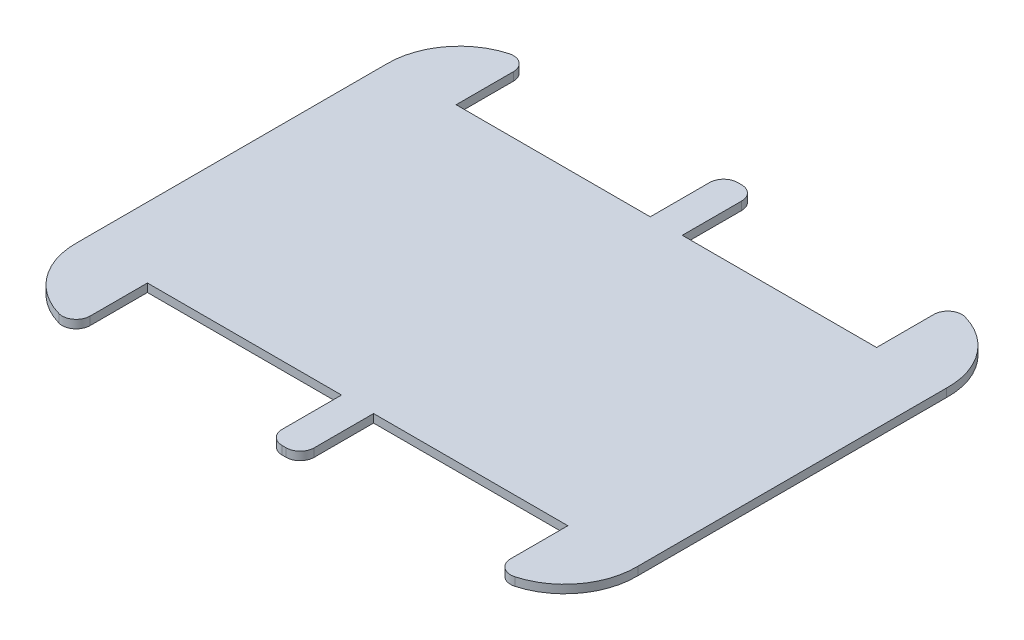
ISO-10303-21;
HEADER;
FILE_DESCRIPTION(('STEP AP214'),'2;1');
FILE_NAME('part.step','',(''),(''),'','','');
FILE_SCHEMA(('AUTOMOTIVE_DESIGN { 1 0 10303 214 1 1 1 1 }'));
ENDSEC;
DATA;
#1=APPLICATION_CONTEXT('core data for automotive mechanical design processes');
#2=APPLICATION_PROTOCOL_DEFINITION('international standard','automotive_design',2000,#1);
#3=PRODUCT_CONTEXT('',#1,'mechanical');
#4=PRODUCT('Part','Part','',(#3));
#5=PRODUCT_RELATED_PRODUCT_CATEGORY('part','',(#4));
#6=PRODUCT_DEFINITION_FORMATION('','',#4);
#7=PRODUCT_DEFINITION_CONTEXT('part definition',#1,'design');
#8=PRODUCT_DEFINITION('design','',#6,#7);
#9=PRODUCT_DEFINITION_SHAPE('','',#8);
#10=(LENGTH_UNIT() NAMED_UNIT(*) SI_UNIT(.MILLI.,.METRE.));
#11=(NAMED_UNIT(*) PLANE_ANGLE_UNIT() SI_UNIT($,.RADIAN.));
#12=(NAMED_UNIT(*) SI_UNIT($,.STERADIAN.) SOLID_ANGLE_UNIT());
#13=UNCERTAINTY_MEASURE_WITH_UNIT(LENGTH_MEASURE(1.E-05),#10,'distance_accuracy_value','');
#14=(GEOMETRIC_REPRESENTATION_CONTEXT(3) GLOBAL_UNCERTAINTY_ASSIGNED_CONTEXT((#13)) GLOBAL_UNIT_ASSIGNED_CONTEXT((#10,
#11,#12)) REPRESENTATION_CONTEXT('',''));
#15=CARTESIAN_POINT('',(0.,0.,0.));
#16=DIRECTION('',(0.,0.,1.));
#17=DIRECTION('',(1.,0.,0.));
#18=AXIS2_PLACEMENT_3D('',#15,#16,#17);
#19=CARTESIAN_POINT('',(-75.6,3.,-56.55));
#20=DIRECTION('',(0.,-1.,0.));
#21=DIRECTION('',(0.,0.,-1.));
#22=AXIS2_PLACEMENT_3D('',#19,#20,#21);
#23=CYLINDRICAL_SURFACE('',#22,26.006922155457);
#24=CARTESIAN_POINT('',(-75.6,3.,-56.55));
#25=DIRECTION('',(0.,1.,0.));
#26=DIRECTION('',(0.,0.,1.));
#27=AXIS2_PLACEMENT_3D('',#24,#25,#26);
#28=CIRCLE('',#27,26.006922155457);
#29=CARTESIAN_POINT('',(-82.658817189917,3.,-81.5806432174511));
#30=VERTEX_POINT('',#29);
#31=CARTESIAN_POINT('',(-101.6,3.,-55.95));
#32=VERTEX_POINT('',#31);
#33=EDGE_CURVE('E217',#30,#32,#28,.T.);
#34=ORIENTED_EDGE('',*,*,#33,.F.);
#35=DIRECTION('',(0.,-1.,0.));
#36=VECTOR('',#35,1.);
#37=CARTESIAN_POINT('',(-82.658817189917,3.,-81.5806432174511));
#38=LINE('',#37,#36);
#39=CARTESIAN_POINT('',(-82.658817189917,0.,-81.5806432174511));
#40=VERTEX_POINT('',#39);
#41=EDGE_CURVE('E305',#30,#40,#38,.T.);
#42=ORIENTED_EDGE('',*,*,#41,.T.);
#43=CARTESIAN_POINT('',(-75.6,0.,-56.55));
#44=DIRECTION('',(0.,1.,0.));
#45=DIRECTION('',(0.,0.,1.));
#46=AXIS2_PLACEMENT_3D('',#43,#44,#45);
#47=CIRCLE('',#46,26.006922155457);
#48=CARTESIAN_POINT('',(-101.6,0.,-55.95));
#49=VERTEX_POINT('',#48);
#50=EDGE_CURVE('E243',#40,#49,#47,.T.);
#51=ORIENTED_EDGE('',*,*,#50,.T.);
#52=DIRECTION('',(0.,-1.,0.));
#53=VECTOR('',#52,1.);
#54=CARTESIAN_POINT('',(-101.6,3.,-55.95));
#55=LINE('',#54,#53);
#56=EDGE_CURVE('E236',#32,#49,#55,.T.);
#57=ORIENTED_EDGE('',*,*,#56,.F.);
#58=EDGE_LOOP('',(#34,#42,#51,#57));
#59=FACE_BOUND('',#58,.T.);
#60=ADVANCED_FACE('F34',(#59),#23,.T.);
#61=CARTESIAN_POINT('',(-101.6,3.,55.95));
#62=DIRECTION('',(1.,0.,0.));
#63=DIRECTION('',(0.,0.,-1.));
#64=AXIS2_PLACEMENT_3D('',#61,#62,#63);
#65=PLANE('',#64);
#66=DIRECTION('',(0.,0.,1.));
#67=VECTOR('',#66,1.);
#68=CARTESIAN_POINT('',(-101.6,0.,55.95));
#69=LINE('',#68,#67);
#70=CARTESIAN_POINT('',(-101.6,0.,55.95));
#71=VERTEX_POINT('',#70);
#72=EDGE_CURVE('E444',#49,#71,#69,.T.);
#73=ORIENTED_EDGE('',*,*,#72,.T.);
#74=DIRECTION('',(0.,-1.,0.));
#75=VECTOR('',#74,1.);
#76=CARTESIAN_POINT('',(-101.6,3.,55.95));
#77=LINE('',#76,#75);
#78=CARTESIAN_POINT('',(-101.6,3.,55.95));
#79=VERTEX_POINT('',#78);
#80=EDGE_CURVE('E238',#79,#71,#77,.T.);
#81=ORIENTED_EDGE('',*,*,#80,.F.);
#82=DIRECTION('',(0.,0.,1.));
#83=VECTOR('',#82,1.);
#84=CARTESIAN_POINT('',(-101.6,3.,55.95));
#85=LINE('',#84,#83);
#86=EDGE_CURVE('E222',#32,#79,#85,.T.);
#87=ORIENTED_EDGE('',*,*,#86,.F.);
#88=ORIENTED_EDGE('',*,*,#56,.T.);
#89=EDGE_LOOP('',(#73,#81,#87,#88));
#90=FACE_BOUND('',#89,.T.);
#91=ADVANCED_FACE('F235',(#90),#65,.F.);
#92=CARTESIAN_POINT('',(-75.6,3.,56.55));
#93=DIRECTION('',(0.,-1.,0.));
#94=DIRECTION('',(0.,0.,-1.));
#95=AXIS2_PLACEMENT_3D('',#92,#93,#94);
#96=CYLINDRICAL_SURFACE('',#95,26.006922155457);
#97=CARTESIAN_POINT('',(-75.6,0.,56.55));
#98=DIRECTION('',(0.,1.,0.));
#99=DIRECTION('',(0.,0.,-1.));
#100=AXIS2_PLACEMENT_3D('',#97,#98,#99);
#101=CIRCLE('',#100,26.006922155457);
#102=CARTESIAN_POINT('',(-82.658817189917,0.,81.5806432174511));
#103=VERTEX_POINT('',#102);
#104=EDGE_CURVE('E401',#71,#103,#101,.T.);
#105=ORIENTED_EDGE('',*,*,#104,.T.);
#106=DIRECTION('',(0.,-1.,0.));
#107=VECTOR('',#106,1.);
#108=CARTESIAN_POINT('',(-82.658817189917,3.,81.5806432174511));
#109=LINE('',#108,#107);
#110=CARTESIAN_POINT('',(-82.658817189917,3.,81.5806432174511));
#111=VERTEX_POINT('',#110);
#112=EDGE_CURVE('E312',#103,#111,#109,.F.);
#113=ORIENTED_EDGE('',*,*,#112,.T.);
#114=CARTESIAN_POINT('',(-75.6,3.,56.55));
#115=DIRECTION('',(0.,1.,0.));
#116=DIRECTION('',(0.,0.,-1.));
#117=AXIS2_PLACEMENT_3D('',#114,#115,#116);
#118=CIRCLE('',#117,26.006922155457);
#119=EDGE_CURVE('E240',#79,#111,#118,.T.);
#120=ORIENTED_EDGE('',*,*,#119,.F.);
#121=ORIENTED_EDGE('',*,*,#80,.T.);
#122=EDGE_LOOP('',(#105,#113,#120,#121));
#123=FACE_BOUND('',#122,.T.);
#124=ADVANCED_FACE('F449',(#123),#96,.T.);
#125=CARTESIAN_POINT('',(-76.2,3.,82.55));
#126=DIRECTION('',(-1.,0.,0.));
#127=DIRECTION('',(0.,0.,1.));
#128=AXIS2_PLACEMENT_3D('',#125,#126,#127);
#129=PLANE('',#128);
#130=DIRECTION('',(0.,0.,-1.));
#131=VECTOR('',#130,1.);
#132=CARTESIAN_POINT('',(-76.2,3.,82.55));
#133=LINE('',#132,#131);
#134=CARTESIAN_POINT('',(-76.2,3.,76.6913423311496));
#135=VERTEX_POINT('',#134);
#136=CARTESIAN_POINT('',(-76.2,3.,55.95));
#137=VERTEX_POINT('',#136);
#138=EDGE_CURVE('E454',#135,#137,#133,.T.);
#139=ORIENTED_EDGE('',*,*,#138,.F.);
#140=DIRECTION('',(0.,-1.,0.));
#141=VECTOR('',#140,1.);
#142=CARTESIAN_POINT('',(-76.2,3.,76.6913423311496));
#143=LINE('',#142,#141);
#144=CARTESIAN_POINT('',(-76.2,0.,76.6913423311496));
#145=VERTEX_POINT('',#144);
#146=EDGE_CURVE('E309',#135,#145,#143,.T.);
#147=ORIENTED_EDGE('',*,*,#146,.T.);
#148=DIRECTION('',(0.,0.,-1.));
#149=VECTOR('',#148,1.);
#150=CARTESIAN_POINT('',(-76.2,0.,82.55));
#151=LINE('',#150,#149);
#152=CARTESIAN_POINT('',(-76.2,0.,55.95));
#153=VERTEX_POINT('',#152);
#154=EDGE_CURVE('E395',#145,#153,#151,.T.);
#155=ORIENTED_EDGE('',*,*,#154,.T.);
#156=DIRECTION('',(0.,-1.,0.));
#157=VECTOR('',#156,1.);
#158=CARTESIAN_POINT('',(-76.2,3.,55.95));
#159=LINE('',#158,#157);
#160=EDGE_CURVE('E249',#137,#153,#159,.T.);
#161=ORIENTED_EDGE('',*,*,#160,.F.);
#162=EDGE_LOOP('',(#139,#147,#155,#161));
#163=FACE_BOUND('',#162,.T.);
#164=ADVANCED_FACE('F455',(#163),#129,.F.);
#165=CARTESIAN_POINT('',(-76.2,3.,55.95));
#166=DIRECTION('',(0.,0.,-1.));
#167=DIRECTION('',(-1.,0.,0.));
#168=AXIS2_PLACEMENT_3D('',#165,#166,#167);
#169=PLANE('',#168);
#170=DIRECTION('',(1.,0.,0.));
#171=VECTOR('',#170,1.);
#172=CARTESIAN_POINT('',(-76.2,0.,55.95));
#173=LINE('',#172,#171);
#174=CARTESIAN_POINT('',(-5.842,0.,55.95));
#175=VERTEX_POINT('',#174);
#176=EDGE_CURVE('E389',#153,#175,#173,.T.);
#177=ORIENTED_EDGE('',*,*,#176,.T.);
#178=DIRECTION('',(0.,-1.,0.));
#179=VECTOR('',#178,1.);
#180=CARTESIAN_POINT('',(-5.842,3.,55.95));
#181=LINE('',#180,#179);
#182=CARTESIAN_POINT('',(-5.842,3.,55.95));
#183=VERTEX_POINT('',#182);
#184=EDGE_CURVE('E380',#183,#175,#181,.T.);
#185=ORIENTED_EDGE('',*,*,#184,.F.);
#186=DIRECTION('',(1.,0.,0.));
#187=VECTOR('',#186,1.);
#188=CARTESIAN_POINT('',(-76.2,3.,55.95));
#189=LINE('',#188,#187);
#190=EDGE_CURVE('E390',#137,#183,#189,.T.);
#191=ORIENTED_EDGE('',*,*,#190,.F.);
#192=ORIENTED_EDGE('',*,*,#160,.T.);
#193=EDGE_LOOP('',(#177,#185,#191,#192));
#194=FACE_BOUND('',#193,.T.);
#195=ADVANCED_FACE('F387',(#194),#169,.F.);
#196=CARTESIAN_POINT('',(-5.842,3.,55.95));
#197=DIRECTION('',(1.,0.,0.));
#198=DIRECTION('',(0.,0.,-1.));
#199=AXIS2_PLACEMENT_3D('',#196,#197,#198);
#200=PLANE('',#199);
#201=DIRECTION('',(0.,0.,1.));
#202=VECTOR('',#201,1.);
#203=CARTESIAN_POINT('',(-5.842,0.,55.95));
#204=LINE('',#203,#202);
#205=CARTESIAN_POINT('',(-5.842,0.,77.47));
#206=VERTEX_POINT('',#205);
#207=EDGE_CURVE('E397',#175,#206,#204,.T.);
#208=ORIENTED_EDGE('',*,*,#207,.T.);
#209=DIRECTION('',(0.,-1.,0.));
#210=VECTOR('',#209,1.);
#211=CARTESIAN_POINT('',(-5.842,3.,77.47));
#212=LINE('',#211,#210);
#213=CARTESIAN_POINT('',(-5.842,3.,77.47));
#214=VERTEX_POINT('',#213);
#215=EDGE_CURVE('E259',#206,#214,#212,.F.);
#216=ORIENTED_EDGE('',*,*,#215,.T.);
#217=DIRECTION('',(0.,0.,1.));
#218=VECTOR('',#217,1.);
#219=CARTESIAN_POINT('',(-5.842,3.,55.95));
#220=LINE('',#219,#218);
#221=EDGE_CURVE('E457',#183,#214,#220,.T.);
#222=ORIENTED_EDGE('',*,*,#221,.F.);
#223=ORIENTED_EDGE('',*,*,#184,.T.);
#224=EDGE_LOOP('',(#208,#216,#222,#223));
#225=FACE_BOUND('',#224,.T.);
#226=ADVANCED_FACE('F504',(#225),#200,.F.);
#227=CARTESIAN_POINT('',(-5.842,3.,82.55));
#228=DIRECTION('',(0.,0.,-1.));
#229=DIRECTION('',(-1.,0.,0.));
#230=AXIS2_PLACEMENT_3D('',#227,#228,#229);
#231=PLANE('',#230);
#232=DIRECTION('',(1.,0.,0.));
#233=VECTOR('',#232,1.);
#234=CARTESIAN_POINT('',(-5.842,3.,82.55));
#235=LINE('',#234,#233);
#236=CARTESIAN_POINT('',(-0.761999999999996,3.,82.55));
#237=VERTEX_POINT('',#236);
#238=CARTESIAN_POINT('',(0.69022165585403,3.,82.55));
#239=VERTEX_POINT('',#238);
#240=EDGE_CURVE('E463',#237,#239,#235,.T.);
#241=ORIENTED_EDGE('',*,*,#240,.F.);
#242=DIRECTION('',(0.,-1.,0.));
#243=VECTOR('',#242,1.);
#244=CARTESIAN_POINT('',(-0.761999999999996,3.,82.55));
#245=LINE('',#244,#243);
#246=CARTESIAN_POINT('',(-0.761999999999996,0.,82.55));
#247=VERTEX_POINT('',#246);
#248=EDGE_CURVE('E247',#237,#247,#245,.T.);
#249=ORIENTED_EDGE('',*,*,#248,.T.);
#250=DIRECTION('',(1.,0.,0.));
#251=VECTOR('',#250,1.);
#252=CARTESIAN_POINT('',(-5.842,0.,82.55));
#253=LINE('',#252,#251);
#254=CARTESIAN_POINT('',(0.69022165585403,0.,82.55));
#255=VERTEX_POINT('',#254);
#256=EDGE_CURVE('E399',#247,#255,#253,.T.);
#257=ORIENTED_EDGE('',*,*,#256,.T.);
#258=DIRECTION('',(0.,-1.,0.));
#259=VECTOR('',#258,1.);
#260=CARTESIAN_POINT('',(0.69022165585403,3.,82.55));
#261=LINE('',#260,#259);
#262=EDGE_CURVE('E245',#255,#239,#261,.F.);
#263=ORIENTED_EDGE('',*,*,#262,.T.);
#264=EDGE_LOOP('',(#241,#249,#257,#263));
#265=FACE_BOUND('',#264,.T.);
#266=ADVANCED_FACE('F475',(#265),#231,.F.);
#267=CARTESIAN_POINT('',(5.77022165585403,3.,82.55));
#268=DIRECTION('',(-1.,0.,0.));
#269=DIRECTION('',(0.,0.,1.));
#270=AXIS2_PLACEMENT_3D('',#267,#268,#269);
#271=PLANE('',#270);
#272=DIRECTION('',(0.,0.,-1.));
#273=VECTOR('',#272,1.);
#274=CARTESIAN_POINT('',(5.77022165585403,3.,82.55));
#275=LINE('',#274,#273);
#276=CARTESIAN_POINT('',(5.77022165585403,3.,77.47));
#277=VERTEX_POINT('',#276);
#278=CARTESIAN_POINT('',(5.77022165585403,3.,55.95));
#279=VERTEX_POINT('',#278);
#280=EDGE_CURVE('E421',#277,#279,#275,.T.);
#281=ORIENTED_EDGE('',*,*,#280,.F.);
#282=DIRECTION('',(0.,-1.,0.));
#283=VECTOR('',#282,1.);
#284=CARTESIAN_POINT('',(5.77022165585403,3.,77.47));
#285=LINE('',#284,#283);
#286=CARTESIAN_POINT('',(5.77022165585403,0.,77.47));
#287=VERTEX_POINT('',#286);
#288=EDGE_CURVE('E265',#277,#287,#285,.T.);
#289=ORIENTED_EDGE('',*,*,#288,.T.);
#290=DIRECTION('',(0.,0.,-1.));
#291=VECTOR('',#290,1.);
#292=CARTESIAN_POINT('',(5.77022165585403,0.,82.55));
#293=LINE('',#292,#291);
#294=CARTESIAN_POINT('',(5.77022165585403,0.,55.95));
#295=VERTEX_POINT('',#294);
#296=EDGE_CURVE('E407',#287,#295,#293,.T.);
#297=ORIENTED_EDGE('',*,*,#296,.T.);
#298=DIRECTION('',(0.,-1.,0.));
#299=VECTOR('',#298,1.);
#300=CARTESIAN_POINT('',(5.77022165585403,3.,55.95));
#301=LINE('',#300,#299);
#302=EDGE_CURVE('E377',#279,#295,#301,.T.);
#303=ORIENTED_EDGE('',*,*,#302,.F.);
#304=EDGE_LOOP('',(#281,#289,#297,#303));
#305=FACE_BOUND('',#304,.T.);
#306=ADVANCED_FACE('F469',(#305),#271,.F.);
#307=CARTESIAN_POINT('',(5.77022165585403,3.,55.95));
#308=DIRECTION('',(0.,0.,-1.));
#309=DIRECTION('',(-1.,0.,0.));
#310=AXIS2_PLACEMENT_3D('',#307,#308,#309);
#311=PLANE('',#310);
#312=DIRECTION('',(1.,0.,0.));
#313=VECTOR('',#312,1.);
#314=CARTESIAN_POINT('',(5.77022165585403,0.,55.95));
#315=LINE('',#314,#313);
#316=CARTESIAN_POINT('',(76.2,0.,55.95));
#317=VERTEX_POINT('',#316);
#318=EDGE_CURVE('E334',#295,#317,#315,.T.);
#319=ORIENTED_EDGE('',*,*,#318,.T.);
#320=DIRECTION('',(0.,-1.,0.));
#321=VECTOR('',#320,1.);
#322=CARTESIAN_POINT('',(76.2,3.,55.95));
#323=LINE('',#322,#321);
#324=CARTESIAN_POINT('',(76.2,3.,55.95));
#325=VERTEX_POINT('',#324);
#326=EDGE_CURVE('E374',#325,#317,#323,.T.);
#327=ORIENTED_EDGE('',*,*,#326,.F.);
#328=DIRECTION('',(1.,0.,0.));
#329=VECTOR('',#328,1.);
#330=CARTESIAN_POINT('',(5.77022165585403,3.,55.95));
#331=LINE('',#330,#329);
#332=EDGE_CURVE('E417',#279,#325,#331,.T.);
#333=ORIENTED_EDGE('',*,*,#332,.F.);
#334=ORIENTED_EDGE('',*,*,#302,.T.);
#335=EDGE_LOOP('',(#319,#327,#333,#334));
#336=FACE_BOUND('',#335,.T.);
#337=ADVANCED_FACE('F411',(#336),#311,.F.);
#338=CARTESIAN_POINT('',(76.2,3.,55.95));
#339=DIRECTION('',(1.,0.,0.));
#340=DIRECTION('',(0.,0.,-1.));
#341=AXIS2_PLACEMENT_3D('',#338,#339,#340);
#342=PLANE('',#341);
#343=DIRECTION('',(0.,0.,1.));
#344=VECTOR('',#343,1.);
#345=CARTESIAN_POINT('',(76.2,0.,55.95));
#346=LINE('',#345,#344);
#347=CARTESIAN_POINT('',(76.2,0.,76.6913423311495));
#348=VERTEX_POINT('',#347);
#349=EDGE_CURVE('E330',#317,#348,#346,.T.);
#350=ORIENTED_EDGE('',*,*,#349,.T.);
#351=DIRECTION('',(0.,-1.,0.));
#352=VECTOR('',#351,1.);
#353=CARTESIAN_POINT('',(76.2,3.,76.6913423311495));
#354=LINE('',#353,#352);
#355=CARTESIAN_POINT('',(76.2,3.,76.6913423311495));
#356=VERTEX_POINT('',#355);
#357=EDGE_CURVE('E11',#348,#356,#354,.F.);
#358=ORIENTED_EDGE('',*,*,#357,.T.);
#359=DIRECTION('',(0.,0.,1.));
#360=VECTOR('',#359,1.);
#361=CARTESIAN_POINT('',(76.2,3.,55.95));
#362=LINE('',#361,#360);
#363=EDGE_CURVE('E416',#325,#356,#362,.T.);
#364=ORIENTED_EDGE('',*,*,#363,.F.);
#365=ORIENTED_EDGE('',*,*,#326,.T.);
#366=EDGE_LOOP('',(#350,#358,#364,#365));
#367=FACE_BOUND('',#366,.T.);
#368=ADVANCED_FACE('F415',(#367),#342,.F.);
#369=CARTESIAN_POINT('',(75.6,3.,56.55));
#370=DIRECTION('',(0.,-1.,0.));
#371=DIRECTION('',(0.,0.,-1.));
#372=AXIS2_PLACEMENT_3D('',#369,#370,#371);
#373=CYLINDRICAL_SURFACE('',#372,26.006922155457);
#374=CARTESIAN_POINT('',(75.6,3.,56.55));
#375=DIRECTION('',(0.,1.,0.));
#376=DIRECTION('',(0.,0.,1.));
#377=AXIS2_PLACEMENT_3D('',#374,#375,#376);
#378=CIRCLE('',#377,26.006922155457);
#379=CARTESIAN_POINT('',(82.658817189917,3.,81.5806432174511));
#380=VERTEX_POINT('',#379);
#381=CARTESIAN_POINT('',(101.6,3.,55.95));
#382=VERTEX_POINT('',#381);
#383=EDGE_CURVE('E321',#380,#382,#378,.T.);
#384=ORIENTED_EDGE('',*,*,#383,.F.);
#385=DIRECTION('',(0.,-1.,0.));
#386=VECTOR('',#385,1.);
#387=CARTESIAN_POINT('',(82.658817189917,3.,81.5806432174511));
#388=LINE('',#387,#386);
#389=CARTESIAN_POINT('',(82.658817189917,0.,81.5806432174511));
#390=VERTEX_POINT('',#389);
#391=EDGE_CURVE('E42',#380,#390,#388,.T.);
#392=ORIENTED_EDGE('',*,*,#391,.T.);
#393=CARTESIAN_POINT('',(75.6,0.,56.55));
#394=DIRECTION('',(0.,1.,0.));
#395=DIRECTION('',(0.,0.,1.));
#396=AXIS2_PLACEMENT_3D('',#393,#394,#395);
#397=CIRCLE('',#396,26.006922155457);
#398=CARTESIAN_POINT('',(101.6,0.,55.95));
#399=VERTEX_POINT('',#398);
#400=EDGE_CURVE('E319',#390,#399,#397,.T.);
#401=ORIENTED_EDGE('',*,*,#400,.T.);
#402=DIRECTION('',(0.,-1.,0.));
#403=VECTOR('',#402,1.);
#404=CARTESIAN_POINT('',(101.6,3.,55.95));
#405=LINE('',#404,#403);
#406=EDGE_CURVE('E372',#382,#399,#405,.T.);
#407=ORIENTED_EDGE('',*,*,#406,.F.);
#408=EDGE_LOOP('',(#384,#392,#401,#407));
#409=FACE_BOUND('',#408,.T.);
#410=ADVANCED_FACE('F317',(#409),#373,.T.);
#411=CARTESIAN_POINT('',(101.6,3.,55.95));
#412=DIRECTION('',(-1.,0.,0.));
#413=DIRECTION('',(0.,0.,1.));
#414=AXIS2_PLACEMENT_3D('',#411,#412,#413);
#415=PLANE('',#414);
#416=DIRECTION('',(0.,0.,-1.));
#417=VECTOR('',#416,1.);
#418=CARTESIAN_POINT('',(101.6,0.,55.95));
#419=LINE('',#418,#417);
#420=CARTESIAN_POINT('',(101.6,0.,-55.95));
#421=VERTEX_POINT('',#420);
#422=EDGE_CURVE('E329',#399,#421,#419,.T.);
#423=ORIENTED_EDGE('',*,*,#422,.T.);
#424=DIRECTION('',(0.,-1.,0.));
#425=VECTOR('',#424,1.);
#426=CARTESIAN_POINT('',(101.6,3.,-55.95));
#427=LINE('',#426,#425);
#428=CARTESIAN_POINT('',(101.6,3.,-55.95));
#429=VERTEX_POINT('',#428);
#430=EDGE_CURVE('E369',#429,#421,#427,.T.);
#431=ORIENTED_EDGE('',*,*,#430,.F.);
#432=DIRECTION('',(0.,0.,-1.));
#433=VECTOR('',#432,1.);
#434=CARTESIAN_POINT('',(101.6,3.,55.95));
#435=LINE('',#434,#433);
#436=EDGE_CURVE('E419',#382,#429,#435,.T.);
#437=ORIENTED_EDGE('',*,*,#436,.F.);
#438=ORIENTED_EDGE('',*,*,#406,.T.);
#439=EDGE_LOOP('',(#423,#431,#437,#438));
#440=FACE_BOUND('',#439,.T.);
#441=ADVANCED_FACE('F518',(#440),#415,.F.);
#442=CARTESIAN_POINT('',(75.6,3.,-56.55));
#443=DIRECTION('',(0.,-1.,0.));
#444=DIRECTION('',(0.,0.,-1.));
#445=AXIS2_PLACEMENT_3D('',#442,#443,#444);
#446=CYLINDRICAL_SURFACE('',#445,26.006922155457);
#447=CARTESIAN_POINT('',(75.6,0.,-56.55));
#448=DIRECTION('',(0.,1.,0.));
#449=DIRECTION('',(0.,0.,-1.));
#450=AXIS2_PLACEMENT_3D('',#447,#448,#449);
#451=CIRCLE('',#450,26.006922155457);
#452=CARTESIAN_POINT('',(82.658817189917,0.,-81.5806432174511));
#453=VERTEX_POINT('',#452);
#454=EDGE_CURVE('E332',#421,#453,#451,.T.);
#455=ORIENTED_EDGE('',*,*,#454,.T.);
#456=DIRECTION('',(0.,-1.,0.));
#457=VECTOR('',#456,1.);
#458=CARTESIAN_POINT('',(82.658817189917,3.,-81.5806432174511));
#459=LINE('',#458,#457);
#460=CARTESIAN_POINT('',(82.658817189917,3.,-81.5806432174511));
#461=VERTEX_POINT('',#460);
#462=EDGE_CURVE('E297',#453,#461,#459,.F.);
#463=ORIENTED_EDGE('',*,*,#462,.T.);
#464=CARTESIAN_POINT('',(75.6,3.,-56.55));
#465=DIRECTION('',(0.,1.,0.));
#466=DIRECTION('',(0.,0.,-1.));
#467=AXIS2_PLACEMENT_3D('',#464,#465,#466);
#468=CIRCLE('',#467,26.006922155457);
#469=EDGE_CURVE('E426',#429,#461,#468,.T.);
#470=ORIENTED_EDGE('',*,*,#469,.F.);
#471=ORIENTED_EDGE('',*,*,#430,.T.);
#472=EDGE_LOOP('',(#455,#463,#470,#471));
#473=FACE_BOUND('',#472,.T.);
#474=ADVANCED_FACE('F521',(#473),#446,.T.);
#475=CARTESIAN_POINT('',(76.2,3.,-82.55));
#476=DIRECTION('',(1.,0.,0.));
#477=DIRECTION('',(0.,0.,-1.));
#478=AXIS2_PLACEMENT_3D('',#475,#476,#477);
#479=PLANE('',#478);
#480=DIRECTION('',(0.,0.,1.));
#481=VECTOR('',#480,1.);
#482=CARTESIAN_POINT('',(76.2,3.,-82.55));
#483=LINE('',#482,#481);
#484=CARTESIAN_POINT('',(76.2,3.,-76.6913423311495));
#485=VERTEX_POINT('',#484);
#486=CARTESIAN_POINT('',(76.2,3.,-55.95));
#487=VERTEX_POINT('',#486);
#488=EDGE_CURVE('E428',#485,#487,#483,.T.);
#489=ORIENTED_EDGE('',*,*,#488,.F.);
#490=DIRECTION('',(0.,-1.,0.));
#491=VECTOR('',#490,1.);
#492=CARTESIAN_POINT('',(76.2,3.,-76.6913423311495));
#493=LINE('',#492,#491);
#494=CARTESIAN_POINT('',(76.2,0.,-76.6913423311495));
#495=VERTEX_POINT('',#494);
#496=EDGE_CURVE('E286',#485,#495,#493,.T.);
#497=ORIENTED_EDGE('',*,*,#496,.T.);
#498=DIRECTION('',(0.,0.,1.));
#499=VECTOR('',#498,1.);
#500=CARTESIAN_POINT('',(76.2,0.,-82.55));
#501=LINE('',#500,#499);
#502=CARTESIAN_POINT('',(76.2,0.,-55.95));
#503=VERTEX_POINT('',#502);
#504=EDGE_CURVE('E340',#495,#503,#501,.T.);
#505=ORIENTED_EDGE('',*,*,#504,.T.);
#506=DIRECTION('',(0.,-1.,0.));
#507=VECTOR('',#506,1.);
#508=CARTESIAN_POINT('',(76.2,3.,-55.95));
#509=LINE('',#508,#507);
#510=EDGE_CURVE('E366',#487,#503,#509,.T.);
#511=ORIENTED_EDGE('',*,*,#510,.F.);
#512=EDGE_LOOP('',(#489,#497,#505,#511));
#513=FACE_BOUND('',#512,.T.);
#514=ADVANCED_FACE('F525',(#513),#479,.F.);
#515=CARTESIAN_POINT('',(76.2,3.,-55.95));
#516=DIRECTION('',(1.86859595353646E-06,0.,0.999999999998254));
#517=DIRECTION('',(0.999999999998254,0.,-1.86859595353647E-06));
#518=AXIS2_PLACEMENT_3D('',#515,#516,#517);
#519=PLANE('',#518);
#520=DIRECTION('',(-0.999999999998254,0.,1.86859595353646E-06));
#521=VECTOR('',#520,1.);
#522=CARTESIAN_POINT('',(76.2,0.,-55.95));
#523=LINE('',#522,#521);
#524=CARTESIAN_POINT('',(5.77022165585403,0.,-55.9498683952012));
#525=VERTEX_POINT('',#524);
#526=EDGE_CURVE('E342',#503,#525,#523,.T.);
#527=ORIENTED_EDGE('',*,*,#526,.T.);
#528=DIRECTION('',(0.,-1.,0.));
#529=VECTOR('',#528,1.);
#530=CARTESIAN_POINT('',(5.77022165585403,3.,-55.9498683952012));
#531=LINE('',#530,#529);
#532=CARTESIAN_POINT('',(5.77022165585403,3.,-55.9498683952012));
#533=VERTEX_POINT('',#532);
#534=EDGE_CURVE('E363',#533,#525,#531,.T.);
#535=ORIENTED_EDGE('',*,*,#534,.F.);
#536=DIRECTION('',(-0.999999999998254,0.,1.86859595353646E-06));
#537=VECTOR('',#536,1.);
#538=CARTESIAN_POINT('',(76.2,3.,-55.95));
#539=LINE('',#538,#537);
#540=EDGE_CURVE('E430',#487,#533,#539,.T.);
#541=ORIENTED_EDGE('',*,*,#540,.F.);
#542=ORIENTED_EDGE('',*,*,#510,.T.);
#543=EDGE_LOOP('',(#527,#535,#541,#542));
#544=FACE_BOUND('',#543,.T.);
#545=ADVANCED_FACE('F529',(#544),#519,.F.);
#546=CARTESIAN_POINT('',(5.77022165585403,3.,-55.9498683952012));
#547=DIRECTION('',(-1.,0.,0.));
#548=DIRECTION('',(0.,0.,1.));
#549=AXIS2_PLACEMENT_3D('',#546,#547,#548);
#550=PLANE('',#549);
#551=DIRECTION('',(0.,0.,-1.));
#552=VECTOR('',#551,1.);
#553=CARTESIAN_POINT('',(5.77022165585403,0.,-55.9498683952012));
#554=LINE('',#553,#552);
#555=CARTESIAN_POINT('',(5.77022165585403,0.,-77.47));
#556=VERTEX_POINT('',#555);
#557=EDGE_CURVE('E344',#525,#556,#554,.T.);
#558=ORIENTED_EDGE('',*,*,#557,.T.);
#559=DIRECTION('',(0.,-1.,0.));
#560=VECTOR('',#559,1.);
#561=CARTESIAN_POINT('',(5.77022165585403,3.,-77.47));
#562=LINE('',#561,#560);
#563=CARTESIAN_POINT('',(5.77022165585403,3.,-77.47));
#564=VERTEX_POINT('',#563);
#565=EDGE_CURVE('E284',#556,#564,#562,.F.);
#566=ORIENTED_EDGE('',*,*,#565,.T.);
#567=DIRECTION('',(0.,0.,-1.));
#568=VECTOR('',#567,1.);
#569=CARTESIAN_POINT('',(5.77022165585403,3.,-55.9498683952012));
#570=LINE('',#569,#568);
#571=EDGE_CURVE('E432',#533,#564,#570,.T.);
#572=ORIENTED_EDGE('',*,*,#571,.F.);
#573=ORIENTED_EDGE('',*,*,#534,.T.);
#574=EDGE_LOOP('',(#558,#566,#572,#573));
#575=FACE_BOUND('',#574,.T.);
#576=ADVANCED_FACE('F533',(#575),#550,.F.);
#577=CARTESIAN_POINT('',(5.77022165585403,3.,-82.55));
#578=DIRECTION('',(0.,0.,1.));
#579=DIRECTION('',(1.,0.,0.));
#580=AXIS2_PLACEMENT_3D('',#577,#578,#579);
#581=PLANE('',#580);
#582=DIRECTION('',(-1.,0.,0.));
#583=VECTOR('',#582,1.);
#584=CARTESIAN_POINT('',(5.77022165585403,0.,-82.55));
#585=LINE('',#584,#583);
#586=CARTESIAN_POINT('',(0.69022165585403,0.,-82.55));
#587=VERTEX_POINT('',#586);
#588=CARTESIAN_POINT('',(-0.762000000000001,0.,-82.55));
#589=VERTEX_POINT('',#588);
#590=EDGE_CURVE('E347',#587,#589,#585,.T.);
#591=ORIENTED_EDGE('',*,*,#590,.T.);
#592=DIRECTION('',(0.,-1.,0.));
#593=VECTOR('',#592,1.);
#594=CARTESIAN_POINT('',(-0.762000000000001,3.,-82.55));
#595=LINE('',#594,#593);
#596=CARTESIAN_POINT('',(-0.762000000000001,3.,-82.55));
#597=VERTEX_POINT('',#596);
#598=EDGE_CURVE('E278',#589,#597,#595,.F.);
#599=ORIENTED_EDGE('',*,*,#598,.T.);
#600=DIRECTION('',(-1.,0.,0.));
#601=VECTOR('',#600,1.);
#602=CARTESIAN_POINT('',(5.77022165585403,3.,-82.55));
#603=LINE('',#602,#601);
#604=CARTESIAN_POINT('',(0.69022165585403,3.,-82.55));
#605=VERTEX_POINT('',#604);
#606=EDGE_CURVE('E435',#605,#597,#603,.T.);
#607=ORIENTED_EDGE('',*,*,#606,.F.);
#608=DIRECTION('',(0.,-1.,0.));
#609=VECTOR('',#608,1.);
#610=CARTESIAN_POINT('',(0.69022165585403,3.,-82.55));
#611=LINE('',#610,#609);
#612=EDGE_CURVE('E275',#605,#587,#611,.T.);
#613=ORIENTED_EDGE('',*,*,#612,.T.);
#614=EDGE_LOOP('',(#591,#599,#607,#613));
#615=FACE_BOUND('',#614,.T.);
#616=ADVANCED_FACE('F537',(#615),#581,.F.);
#617=CARTESIAN_POINT('',(-5.842,3.,-82.55));
#618=DIRECTION('',(1.,0.,0.));
#619=DIRECTION('',(0.,0.,-1.));
#620=AXIS2_PLACEMENT_3D('',#617,#618,#619);
#621=PLANE('',#620);
#622=DIRECTION('',(0.,0.,1.));
#623=VECTOR('',#622,1.);
#624=CARTESIAN_POINT('',(-5.842,3.,-82.55));
#625=LINE('',#624,#623);
#626=CARTESIAN_POINT('',(-5.842,3.,-77.47));
#627=VERTEX_POINT('',#626);
#628=CARTESIAN_POINT('',(-5.842,3.,-55.95));
#629=VERTEX_POINT('',#628);
#630=EDGE_CURVE('E438',#627,#629,#625,.T.);
#631=ORIENTED_EDGE('',*,*,#630,.F.);
#632=DIRECTION('',(0.,-1.,0.));
#633=VECTOR('',#632,1.);
#634=CARTESIAN_POINT('',(-5.842,3.,-77.47));
#635=LINE('',#634,#633);
#636=CARTESIAN_POINT('',(-5.842,0.,-77.47));
#637=VERTEX_POINT('',#636);
#638=EDGE_CURVE('E268',#627,#637,#635,.T.);
#639=ORIENTED_EDGE('',*,*,#638,.T.);
#640=DIRECTION('',(0.,0.,1.));
#641=VECTOR('',#640,1.);
#642=CARTESIAN_POINT('',(-5.842,0.,-82.55));
#643=LINE('',#642,#641);
#644=CARTESIAN_POINT('',(-5.842,0.,-55.95));
#645=VERTEX_POINT('',#644);
#646=EDGE_CURVE('E350',#637,#645,#643,.T.);
#647=ORIENTED_EDGE('',*,*,#646,.T.);
#648=DIRECTION('',(0.,-1.,0.));
#649=VECTOR('',#648,1.);
#650=CARTESIAN_POINT('',(-5.842,3.,-55.95));
#651=LINE('',#650,#649);
#652=EDGE_CURVE('E359',#629,#645,#651,.T.);
#653=ORIENTED_EDGE('',*,*,#652,.F.);
#654=EDGE_LOOP('',(#631,#639,#647,#653));
#655=FACE_BOUND('',#654,.T.);
#656=ADVANCED_FACE('F541',(#655),#621,.F.);
#657=CARTESIAN_POINT('',(-76.2,3.,-55.95));
#658=DIRECTION('',(0.,0.,1.));
#659=DIRECTION('',(1.,0.,0.));
#660=AXIS2_PLACEMENT_3D('',#657,#658,#659);
#661=PLANE('',#660);
#662=DIRECTION('',(-1.,0.,0.));
#663=VECTOR('',#662,1.);
#664=CARTESIAN_POINT('',(-76.2,0.,-55.95));
#665=LINE('',#664,#663);
#666=CARTESIAN_POINT('',(-76.2,0.,-55.95));
#667=VERTEX_POINT('',#666);
#668=EDGE_CURVE('E352',#645,#667,#665,.T.);
#669=ORIENTED_EDGE('',*,*,#668,.T.);
#670=DIRECTION('',(0.,-1.,0.));
#671=VECTOR('',#670,1.);
#672=CARTESIAN_POINT('',(-76.2,3.,-55.95));
#673=LINE('',#672,#671);
#674=CARTESIAN_POINT('',(-76.2,3.,-55.95));
#675=VERTEX_POINT('',#674);
#676=EDGE_CURVE('E356',#675,#667,#673,.T.);
#677=ORIENTED_EDGE('',*,*,#676,.F.);
#678=DIRECTION('',(-1.,0.,0.));
#679=VECTOR('',#678,1.);
#680=CARTESIAN_POINT('',(-76.2,3.,-55.95));
#681=LINE('',#680,#679);
#682=EDGE_CURVE('E440',#629,#675,#681,.T.);
#683=ORIENTED_EDGE('',*,*,#682,.F.);
#684=ORIENTED_EDGE('',*,*,#652,.T.);
#685=EDGE_LOOP('',(#669,#677,#683,#684));
#686=FACE_BOUND('',#685,.T.);
#687=ADVANCED_FACE('F545',(#686),#661,.F.);
#688=CARTESIAN_POINT('',(-76.2,3.,-82.55));
#689=DIRECTION('',(-1.,0.,0.));
#690=DIRECTION('',(0.,0.,1.));
#691=AXIS2_PLACEMENT_3D('',#688,#689,#690);
#692=PLANE('',#691);
#693=DIRECTION('',(0.,0.,-1.));
#694=VECTOR('',#693,1.);
#695=CARTESIAN_POINT('',(-76.2,0.,-82.55));
#696=LINE('',#695,#694);
#697=CARTESIAN_POINT('',(-76.2,0.,-76.6913423311495));
#698=VERTEX_POINT('',#697);
#699=EDGE_CURVE('E231',#667,#698,#696,.T.);
#700=ORIENTED_EDGE('',*,*,#699,.T.);
#701=DIRECTION('',(0.,-1.,0.));
#702=VECTOR('',#701,1.);
#703=CARTESIAN_POINT('',(-76.2,3.,-76.6913423311495));
#704=LINE('',#703,#702);
#705=CARTESIAN_POINT('',(-76.2,3.,-76.6913423311495));
#706=VERTEX_POINT('',#705);
#707=EDGE_CURVE('E307',#698,#706,#704,.F.);
#708=ORIENTED_EDGE('',*,*,#707,.T.);
#709=DIRECTION('',(0.,0.,-1.));
#710=VECTOR('',#709,1.);
#711=CARTESIAN_POINT('',(-76.2,3.,-82.55));
#712=LINE('',#711,#710);
#713=EDGE_CURVE('E360',#675,#706,#712,.T.);
#714=ORIENTED_EDGE('',*,*,#713,.F.);
#715=ORIENTED_EDGE('',*,*,#676,.T.);
#716=EDGE_LOOP('',(#700,#708,#714,#715));
#717=FACE_BOUND('',#716,.T.);
#718=ADVANCED_FACE('F549',(#717),#692,.F.);
#719=CARTESIAN_POINT('',(-75.6,3.,-56.55));
#720=DIRECTION('',(0.,1.,0.));
#721=DIRECTION('',(0.,0.,1.));
#722=AXIS2_PLACEMENT_3D('',#719,#720,#721);
#723=PLANE('',#722);
#724=ORIENTED_EDGE('',*,*,#469,.T.);
#725=CARTESIAN_POINT('',(81.28,3.,-76.6913423311495));
#726=DIRECTION('',(0.,1.,0.));
#727=DIRECTION('',(0.,0.,1.));
#728=AXIS2_PLACEMENT_3D('',#725,#726,#727);
#729=CIRCLE('',#728,5.08);
#730=EDGE_CURVE('E303',#461,#485,#729,.T.);
#731=ORIENTED_EDGE('',*,*,#730,.T.);
#732=ORIENTED_EDGE('',*,*,#488,.T.);
#733=ORIENTED_EDGE('',*,*,#540,.T.);
#734=ORIENTED_EDGE('',*,*,#571,.T.);
#735=CARTESIAN_POINT('',(0.69022165585403,3.,-77.47));
#736=DIRECTION('',(0.,1.,0.));
#737=DIRECTION('',(0.,0.,1.));
#738=AXIS2_PLACEMENT_3D('',#735,#736,#737);
#739=CIRCLE('',#738,5.08);
#740=EDGE_CURVE('E280',#564,#605,#739,.T.);
#741=ORIENTED_EDGE('',*,*,#740,.T.);
#742=ORIENTED_EDGE('',*,*,#606,.T.);
#743=CARTESIAN_POINT('',(-0.762,3.,-77.47));
#744=DIRECTION('',(0.,1.,0.));
#745=DIRECTION('',(0.,0.,1.));
#746=AXIS2_PLACEMENT_3D('',#743,#744,#745);
#747=CIRCLE('',#746,5.08);
#748=EDGE_CURVE('E282',#597,#627,#747,.T.);
#749=ORIENTED_EDGE('',*,*,#748,.T.);
#750=ORIENTED_EDGE('',*,*,#630,.T.);
#751=ORIENTED_EDGE('',*,*,#682,.T.);
#752=ORIENTED_EDGE('',*,*,#713,.T.);
#753=CARTESIAN_POINT('',(-81.28,3.,-76.6913423311495));
#754=DIRECTION('',(0.,1.,0.));
#755=DIRECTION('',(0.,0.,1.));
#756=AXIS2_PLACEMENT_3D('',#753,#754,#755);
#757=CIRCLE('',#756,5.08);
#758=EDGE_CURVE('E226',#706,#30,#757,.T.);
#759=ORIENTED_EDGE('',*,*,#758,.T.);
#760=ORIENTED_EDGE('',*,*,#33,.T.);
#761=ORIENTED_EDGE('',*,*,#86,.T.);
#762=ORIENTED_EDGE('',*,*,#119,.T.);
#763=CARTESIAN_POINT('',(-81.28,3.,76.6913423311496));
#764=DIRECTION('',(0.,1.,0.));
#765=DIRECTION('',(0.,0.,1.));
#766=AXIS2_PLACEMENT_3D('',#763,#764,#765);
#767=CIRCLE('',#766,5.08);
#768=EDGE_CURVE('E300',#111,#135,#767,.T.);
#769=ORIENTED_EDGE('',*,*,#768,.T.);
#770=ORIENTED_EDGE('',*,*,#138,.T.);
#771=ORIENTED_EDGE('',*,*,#190,.T.);
#772=ORIENTED_EDGE('',*,*,#221,.T.);
#773=CARTESIAN_POINT('',(-0.761999999999996,3.,77.47));
#774=DIRECTION('',(0.,1.,0.));
#775=DIRECTION('',(0.,0.,1.));
#776=AXIS2_PLACEMENT_3D('',#773,#774,#775);
#777=CIRCLE('',#776,5.08);
#778=EDGE_CURVE('E263',#214,#237,#777,.T.);
#779=ORIENTED_EDGE('',*,*,#778,.T.);
#780=ORIENTED_EDGE('',*,*,#240,.T.);
#781=CARTESIAN_POINT('',(0.69022165585403,3.,77.47));
#782=DIRECTION('',(0.,1.,0.));
#783=DIRECTION('',(0.,0.,1.));
#784=AXIS2_PLACEMENT_3D('',#781,#782,#783);
#785=CIRCLE('',#784,5.08);
#786=EDGE_CURVE('E261',#239,#277,#785,.T.);
#787=ORIENTED_EDGE('',*,*,#786,.T.);
#788=ORIENTED_EDGE('',*,*,#280,.T.);
#789=ORIENTED_EDGE('',*,*,#332,.T.);
#790=ORIENTED_EDGE('',*,*,#363,.T.);
#791=CARTESIAN_POINT('',(81.28,3.,76.6913423311495));
#792=DIRECTION('',(0.,1.,0.));
#793=DIRECTION('',(0.,0.,1.));
#794=AXIS2_PLACEMENT_3D('',#791,#792,#793);
#795=CIRCLE('',#794,5.08);
#796=EDGE_CURVE('E49',#356,#380,#795,.T.);
#797=ORIENTED_EDGE('',*,*,#796,.T.);
#798=ORIENTED_EDGE('',*,*,#383,.T.);
#799=ORIENTED_EDGE('',*,*,#436,.T.);
#800=EDGE_LOOP('',(#724,#731,#732,#733,#734,#741,#742,#749,#750,#751,#752,#759,#760,#761,#762,
#769,#770,#771,#772,#779,#780,#787,#788,#789,#790,#797,#798,#799));
#801=FACE_BOUND('',#800,.T.);
#802=ADVANCED_FACE('F220',(#801),#723,.T.);
#803=CARTESIAN_POINT('',(-75.6,0.,-56.55));
#804=DIRECTION('',(0.,1.,0.));
#805=DIRECTION('',(0.,0.,1.));
#806=AXIS2_PLACEMENT_3D('',#803,#804,#805);
#807=PLANE('',#806);
#808=ORIENTED_EDGE('',*,*,#504,.F.);
#809=CARTESIAN_POINT('',(81.28,0.,-76.6913423311495));
#810=DIRECTION('',(0.,1.,0.));
#811=DIRECTION('',(0.,0.,1.));
#812=AXIS2_PLACEMENT_3D('',#809,#810,#811);
#813=CIRCLE('',#812,5.08);
#814=EDGE_CURVE('E295',#495,#453,#813,.F.);
#815=ORIENTED_EDGE('',*,*,#814,.T.);
#816=ORIENTED_EDGE('',*,*,#454,.F.);
#817=ORIENTED_EDGE('',*,*,#422,.F.);
#818=ORIENTED_EDGE('',*,*,#400,.F.);
#819=CARTESIAN_POINT('',(81.28,0.,76.6913423311495));
#820=DIRECTION('',(0.,1.,0.));
#821=DIRECTION('',(0.,0.,1.));
#822=AXIS2_PLACEMENT_3D('',#819,#820,#821);
#823=CIRCLE('',#822,5.08);
#824=EDGE_CURVE('E289',#390,#348,#823,.F.);
#825=ORIENTED_EDGE('',*,*,#824,.T.);
#826=ORIENTED_EDGE('',*,*,#349,.F.);
#827=ORIENTED_EDGE('',*,*,#318,.F.);
#828=ORIENTED_EDGE('',*,*,#296,.F.);
#829=CARTESIAN_POINT('',(0.69022165585403,0.,77.47));
#830=DIRECTION('',(0.,1.,0.));
#831=DIRECTION('',(0.,0.,1.));
#832=AXIS2_PLACEMENT_3D('',#829,#830,#831);
#833=CIRCLE('',#832,5.08);
#834=EDGE_CURVE('E255',#287,#255,#833,.F.);
#835=ORIENTED_EDGE('',*,*,#834,.T.);
#836=ORIENTED_EDGE('',*,*,#256,.F.);
#837=CARTESIAN_POINT('',(-0.761999999999996,0.,77.47));
#838=DIRECTION('',(0.,1.,0.));
#839=DIRECTION('',(0.,0.,1.));
#840=AXIS2_PLACEMENT_3D('',#837,#838,#839);
#841=CIRCLE('',#840,5.08);
#842=EDGE_CURVE('E257',#247,#206,#841,.F.);
#843=ORIENTED_EDGE('',*,*,#842,.T.);
#844=ORIENTED_EDGE('',*,*,#207,.F.);
#845=ORIENTED_EDGE('',*,*,#176,.F.);
#846=ORIENTED_EDGE('',*,*,#154,.F.);
#847=CARTESIAN_POINT('',(-81.28,0.,76.6913423311496));
#848=DIRECTION('',(0.,1.,0.));
#849=DIRECTION('',(0.,0.,1.));
#850=AXIS2_PLACEMENT_3D('',#847,#848,#849);
#851=CIRCLE('',#850,5.08);
#852=EDGE_CURVE('E291',#145,#103,#851,.F.);
#853=ORIENTED_EDGE('',*,*,#852,.T.);
#854=ORIENTED_EDGE('',*,*,#104,.F.);
#855=ORIENTED_EDGE('',*,*,#72,.F.);
#856=ORIENTED_EDGE('',*,*,#50,.F.);
#857=CARTESIAN_POINT('',(-81.28,0.,-76.6913423311495));
#858=DIRECTION('',(0.,1.,0.));
#859=DIRECTION('',(0.,0.,1.));
#860=AXIS2_PLACEMENT_3D('',#857,#858,#859);
#861=CIRCLE('',#860,5.08);
#862=EDGE_CURVE('E293',#40,#698,#861,.F.);
#863=ORIENTED_EDGE('',*,*,#862,.T.);
#864=ORIENTED_EDGE('',*,*,#699,.F.);
#865=ORIENTED_EDGE('',*,*,#668,.F.);
#866=ORIENTED_EDGE('',*,*,#646,.F.);
#867=CARTESIAN_POINT('',(-0.762,0.,-77.47));
#868=DIRECTION('',(0.,1.,0.));
#869=DIRECTION('',(0.,0.,1.));
#870=AXIS2_PLACEMENT_3D('',#867,#868,#869);
#871=CIRCLE('',#870,5.08);
#872=EDGE_CURVE('E273',#637,#589,#871,.F.);
#873=ORIENTED_EDGE('',*,*,#872,.T.);
#874=ORIENTED_EDGE('',*,*,#590,.F.);
#875=CARTESIAN_POINT('',(0.69022165585403,0.,-77.47));
#876=DIRECTION('',(0.,1.,0.));
#877=DIRECTION('',(0.,0.,1.));
#878=AXIS2_PLACEMENT_3D('',#875,#876,#877);
#879=CIRCLE('',#878,5.08);
#880=EDGE_CURVE('E271',#587,#556,#879,.F.);
#881=ORIENTED_EDGE('',*,*,#880,.T.);
#882=ORIENTED_EDGE('',*,*,#557,.F.);
#883=ORIENTED_EDGE('',*,*,#526,.F.);
#884=EDGE_LOOP('',(#808,#815,#816,#817,#818,#825,#826,#827,#828,#835,#836,#843,#844,#845,#846,
#853,#854,#855,#856,#863,#864,#865,#866,#873,#874,#881,#882,#883));
#885=FACE_BOUND('',#884,.T.);
#886=ADVANCED_FACE('F326',(#885),#807,.F.);
#887=CARTESIAN_POINT('',(-0.761999999999996,3.,77.47));
#888=DIRECTION('',(0.,-1.,0.));
#889=DIRECTION('',(0.,0.,-1.));
#890=AXIS2_PLACEMENT_3D('',#887,#888,#889);
#891=CYLINDRICAL_SURFACE('',#890,5.08);
#892=ORIENTED_EDGE('',*,*,#778,.F.);
#893=ORIENTED_EDGE('',*,*,#215,.F.);
#894=ORIENTED_EDGE('',*,*,#842,.F.);
#895=ORIENTED_EDGE('',*,*,#248,.F.);
#896=EDGE_LOOP('',(#892,#893,#894,#895));
#897=FACE_BOUND('',#896,.T.);
#898=ADVANCED_FACE('F480',(#897),#891,.T.);
#899=CARTESIAN_POINT('',(0.69022165585403,3.,77.47));
#900=DIRECTION('',(0.,-1.,0.));
#901=DIRECTION('',(0.,0.,-1.));
#902=AXIS2_PLACEMENT_3D('',#899,#900,#901);
#903=CYLINDRICAL_SURFACE('',#902,5.08);
#904=ORIENTED_EDGE('',*,*,#786,.F.);
#905=ORIENTED_EDGE('',*,*,#262,.F.);
#906=ORIENTED_EDGE('',*,*,#834,.F.);
#907=ORIENTED_EDGE('',*,*,#288,.F.);
#908=EDGE_LOOP('',(#904,#905,#906,#907));
#909=FACE_BOUND('',#908,.T.);
#910=ADVANCED_FACE('F477',(#909),#903,.T.);
#911=CARTESIAN_POINT('',(-0.762,3.,-77.47));
#912=DIRECTION('',(0.,-1.,0.));
#913=DIRECTION('',(0.,0.,-1.));
#914=AXIS2_PLACEMENT_3D('',#911,#912,#913);
#915=CYLINDRICAL_SURFACE('',#914,5.08);
#916=ORIENTED_EDGE('',*,*,#748,.F.);
#917=ORIENTED_EDGE('',*,*,#598,.F.);
#918=ORIENTED_EDGE('',*,*,#872,.F.);
#919=ORIENTED_EDGE('',*,*,#638,.F.);
#920=EDGE_LOOP('',(#916,#917,#918,#919));
#921=FACE_BOUND('',#920,.T.);
#922=ADVANCED_FACE('F479',(#921),#915,.T.);
#923=CARTESIAN_POINT('',(0.69022165585403,3.,-77.47));
#924=DIRECTION('',(0.,-1.,0.));
#925=DIRECTION('',(0.,0.,-1.));
#926=AXIS2_PLACEMENT_3D('',#923,#924,#925);
#927=CYLINDRICAL_SURFACE('',#926,5.08);
#928=ORIENTED_EDGE('',*,*,#740,.F.);
#929=ORIENTED_EDGE('',*,*,#565,.F.);
#930=ORIENTED_EDGE('',*,*,#880,.F.);
#931=ORIENTED_EDGE('',*,*,#612,.F.);
#932=EDGE_LOOP('',(#928,#929,#930,#931));
#933=FACE_BOUND('',#932,.T.);
#934=ADVANCED_FACE('F486',(#933),#927,.T.);
#935=CARTESIAN_POINT('',(81.28,3.,-76.6913423311495));
#936=DIRECTION('',(0.,-1.,0.));
#937=DIRECTION('',(0.,0.,-1.));
#938=AXIS2_PLACEMENT_3D('',#935,#936,#937);
#939=CYLINDRICAL_SURFACE('',#938,5.08);
#940=ORIENTED_EDGE('',*,*,#730,.F.);
#941=ORIENTED_EDGE('',*,*,#462,.F.);
#942=ORIENTED_EDGE('',*,*,#814,.F.);
#943=ORIENTED_EDGE('',*,*,#496,.F.);
#944=EDGE_LOOP('',(#940,#941,#942,#943));
#945=FACE_BOUND('',#944,.T.);
#946=ADVANCED_FACE('F757',(#945),#939,.T.);
#947=CARTESIAN_POINT('',(-81.28,3.,-76.6913423311495));
#948=DIRECTION('',(0.,-1.,0.));
#949=DIRECTION('',(0.,0.,-1.));
#950=AXIS2_PLACEMENT_3D('',#947,#948,#949);
#951=CYLINDRICAL_SURFACE('',#950,5.08);
#952=ORIENTED_EDGE('',*,*,#758,.F.);
#953=ORIENTED_EDGE('',*,*,#707,.F.);
#954=ORIENTED_EDGE('',*,*,#862,.F.);
#955=ORIENTED_EDGE('',*,*,#41,.F.);
#956=EDGE_LOOP('',(#952,#953,#954,#955));
#957=FACE_BOUND('',#956,.T.);
#958=ADVANCED_FACE('F633',(#957),#951,.T.);
#959=CARTESIAN_POINT('',(-81.28,3.,76.6913423311496));
#960=DIRECTION('',(0.,-1.,0.));
#961=DIRECTION('',(0.,0.,-1.));
#962=AXIS2_PLACEMENT_3D('',#959,#960,#961);
#963=CYLINDRICAL_SURFACE('',#962,5.08);
#964=ORIENTED_EDGE('',*,*,#768,.F.);
#965=ORIENTED_EDGE('',*,*,#112,.F.);
#966=ORIENTED_EDGE('',*,*,#852,.F.);
#967=ORIENTED_EDGE('',*,*,#146,.F.);
#968=EDGE_LOOP('',(#964,#965,#966,#967));
#969=FACE_BOUND('',#968,.T.);
#970=ADVANCED_FACE('F452',(#969),#963,.T.);
#971=CARTESIAN_POINT('',(81.28,3.,76.6913423311495));
#972=DIRECTION('',(0.,-1.,0.));
#973=DIRECTION('',(0.,0.,-1.));
#974=AXIS2_PLACEMENT_3D('',#971,#972,#973);
#975=CYLINDRICAL_SURFACE('',#974,5.08);
#976=ORIENTED_EDGE('',*,*,#796,.F.);
#977=ORIENTED_EDGE('',*,*,#357,.F.);
#978=ORIENTED_EDGE('',*,*,#824,.F.);
#979=ORIENTED_EDGE('',*,*,#391,.F.);
#980=EDGE_LOOP('',(#976,#977,#978,#979));
#981=FACE_BOUND('',#980,.T.);
#982=ADVANCED_FACE('F36',(#981),#975,.T.);
#983=CLOSED_SHELL('',(#60,#91,#124,#164,#195,#226,#266,#306,#337,#368,#410,#441,#474,#514,#545,
#576,#616,#656,#687,#718,#802,#886,#898,#910,#922,#934,#946,#958,#970,#982));
#984=MANIFOLD_SOLID_BREP('B2',#983);
#985=ADVANCED_BREP_SHAPE_REPRESENTATION('',(#18,#984),#14);
#986=SHAPE_DEFINITION_REPRESENTATION(#9,#985);
ENDSEC;
END-ISO-10303-21;
